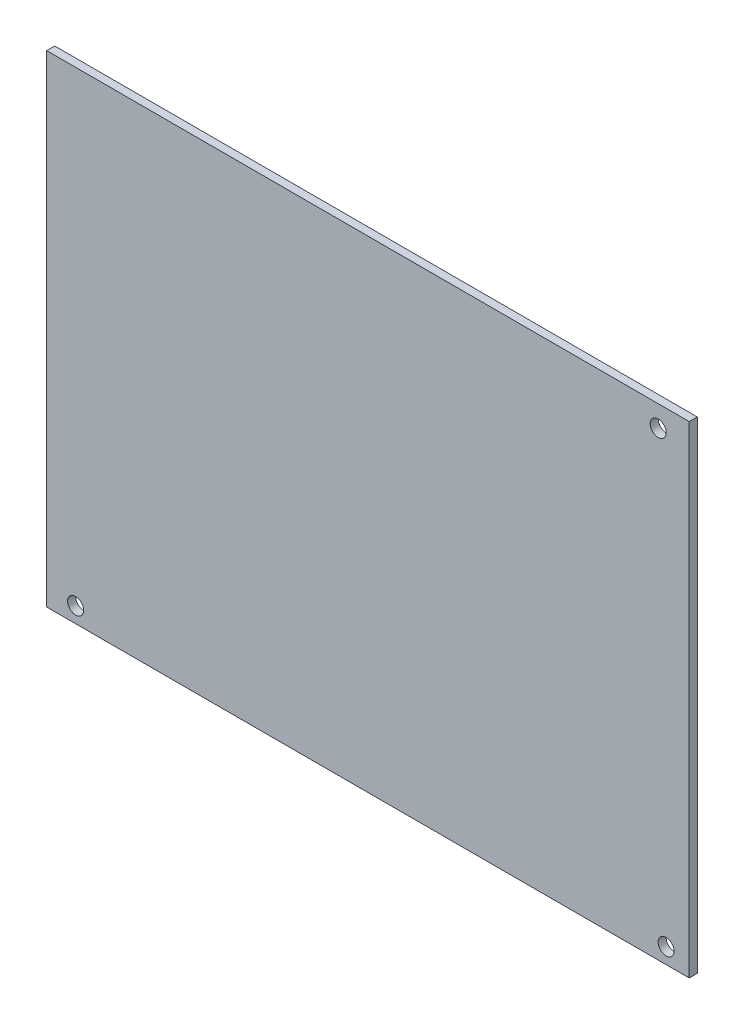
ISO-10303-21;
HEADER;
FILE_DESCRIPTION(('STEP AP214'),'2;1');
FILE_NAME('part.step','',(''),(''),'','','');
FILE_SCHEMA(('AUTOMOTIVE_DESIGN { 1 0 10303 214 1 1 1 1 }'));
ENDSEC;
DATA;
#1=APPLICATION_CONTEXT('core data for automotive mechanical design processes');
#2=APPLICATION_PROTOCOL_DEFINITION('international standard','automotive_design',2000,#1);
#3=PRODUCT_CONTEXT('',#1,'mechanical');
#4=PRODUCT('Part','Part','',(#3));
#5=PRODUCT_RELATED_PRODUCT_CATEGORY('part','',(#4));
#6=PRODUCT_DEFINITION_FORMATION('','',#4);
#7=PRODUCT_DEFINITION_CONTEXT('part definition',#1,'design');
#8=PRODUCT_DEFINITION('design','',#6,#7);
#9=PRODUCT_DEFINITION_SHAPE('','',#8);
#10=(LENGTH_UNIT() NAMED_UNIT(*) SI_UNIT(.MILLI.,.METRE.));
#11=(NAMED_UNIT(*) PLANE_ANGLE_UNIT() SI_UNIT($,.RADIAN.));
#12=(NAMED_UNIT(*) SI_UNIT($,.STERADIAN.) SOLID_ANGLE_UNIT());
#13=UNCERTAINTY_MEASURE_WITH_UNIT(LENGTH_MEASURE(1.E-05),#10,'distance_accuracy_value','');
#14=(GEOMETRIC_REPRESENTATION_CONTEXT(3) GLOBAL_UNCERTAINTY_ASSIGNED_CONTEXT((#13)) GLOBAL_UNIT_ASSIGNED_CONTEXT((#10,
#11,#12)) REPRESENTATION_CONTEXT('',''));
#15=CARTESIAN_POINT('',(0.,0.,0.));
#16=DIRECTION('',(0.,0.,1.));
#17=DIRECTION('',(1.,0.,0.));
#18=AXIS2_PLACEMENT_3D('',#15,#16,#17);
#19=CARTESIAN_POINT('',(0.,0.,2.));
#20=DIRECTION('',(1.,0.,0.));
#21=DIRECTION('',(0.,0.,-1.));
#22=AXIS2_PLACEMENT_3D('',#19,#20,#21);
#23=PLANE('',#22);
#24=DIRECTION('',(0.,-1.,0.));
#25=VECTOR('',#24,1.);
#26=CARTESIAN_POINT('',(0.,0.,0.));
#27=LINE('',#26,#25);
#28=CARTESIAN_POINT('',(0.,120.,0.));
#29=VERTEX_POINT('',#28);
#30=CARTESIAN_POINT('',(0.,0.,0.));
#31=VERTEX_POINT('',#30);
#32=EDGE_CURVE('E100',#29,#31,#27,.T.);
#33=ORIENTED_EDGE('',*,*,#32,.T.);
#34=DIRECTION('',(0.,0.,-1.));
#35=VECTOR('',#34,1.);
#36=CARTESIAN_POINT('',(0.,0.,2.));
#37=LINE('',#36,#35);
#38=CARTESIAN_POINT('',(0.,0.,2.));
#39=VERTEX_POINT('',#38);
#40=EDGE_CURVE('E11',#39,#31,#37,.T.);
#41=ORIENTED_EDGE('',*,*,#40,.F.);
#42=DIRECTION('',(0.,-1.,0.));
#43=VECTOR('',#42,1.);
#44=CARTESIAN_POINT('',(0.,0.,2.));
#45=LINE('',#44,#43);
#46=CARTESIAN_POINT('',(0.,120.,2.));
#47=VERTEX_POINT('',#46);
#48=EDGE_CURVE('E88',#47,#39,#45,.T.);
#49=ORIENTED_EDGE('',*,*,#48,.F.);
#50=DIRECTION('',(0.,0.,-1.));
#51=VECTOR('',#50,1.);
#52=CARTESIAN_POINT('',(0.,120.,2.));
#53=LINE('',#52,#51);
#54=EDGE_CURVE('E96',#47,#29,#53,.T.);
#55=ORIENTED_EDGE('',*,*,#54,.T.);
#56=EDGE_LOOP('',(#33,#41,#49,#55));
#57=FACE_BOUND('',#56,.T.);
#58=ADVANCED_FACE('F37',(#57),#23,.F.);
#59=CARTESIAN_POINT('',(0.,0.,2.));
#60=DIRECTION('',(0.,1.,0.));
#61=DIRECTION('',(0.,0.,1.));
#62=AXIS2_PLACEMENT_3D('',#59,#60,#61);
#63=PLANE('',#62);
#64=DIRECTION('',(1.,0.,0.));
#65=VECTOR('',#64,1.);
#66=CARTESIAN_POINT('',(0.,0.,0.));
#67=LINE('',#66,#65);
#68=CARTESIAN_POINT('',(160.,0.,0.));
#69=VERTEX_POINT('',#68);
#70=EDGE_CURVE('E92',#31,#69,#67,.T.);
#71=ORIENTED_EDGE('',*,*,#70,.T.);
#72=DIRECTION('',(0.,0.,-1.));
#73=VECTOR('',#72,1.);
#74=CARTESIAN_POINT('',(160.,0.,2.));
#75=LINE('',#74,#73);
#76=CARTESIAN_POINT('',(160.,0.,2.));
#77=VERTEX_POINT('',#76);
#78=EDGE_CURVE('E45',#77,#69,#75,.T.);
#79=ORIENTED_EDGE('',*,*,#78,.F.);
#80=DIRECTION('',(1.,0.,0.));
#81=VECTOR('',#80,1.);
#82=CARTESIAN_POINT('',(0.,0.,2.));
#83=LINE('',#82,#81);
#84=EDGE_CURVE('E83',#39,#77,#83,.T.);
#85=ORIENTED_EDGE('',*,*,#84,.F.);
#86=ORIENTED_EDGE('',*,*,#40,.T.);
#87=EDGE_LOOP('',(#71,#79,#85,#86));
#88=FACE_BOUND('',#87,.T.);
#89=ADVANCED_FACE('F91',(#88),#63,.F.);
#90=CARTESIAN_POINT('',(160.,0.,2.));
#91=DIRECTION('',(-1.,0.,0.));
#92=DIRECTION('',(0.,0.,1.));
#93=AXIS2_PLACEMENT_3D('',#90,#91,#92);
#94=PLANE('',#93);
#95=DIRECTION('',(0.,1.,0.));
#96=VECTOR('',#95,1.);
#97=CARTESIAN_POINT('',(160.,0.,0.));
#98=LINE('',#97,#96);
#99=CARTESIAN_POINT('',(160.,120.,0.));
#100=VERTEX_POINT('',#99);
#101=EDGE_CURVE('E70',#69,#100,#98,.T.);
#102=ORIENTED_EDGE('',*,*,#101,.T.);
#103=DIRECTION('',(0.,0.,-1.));
#104=VECTOR('',#103,1.);
#105=CARTESIAN_POINT('',(160.,120.,2.));
#106=LINE('',#105,#104);
#107=CARTESIAN_POINT('',(160.,120.,2.));
#108=VERTEX_POINT('',#107);
#109=EDGE_CURVE('E93',#108,#100,#106,.T.);
#110=ORIENTED_EDGE('',*,*,#109,.F.);
#111=DIRECTION('',(0.,1.,0.));
#112=VECTOR('',#111,1.);
#113=CARTESIAN_POINT('',(160.,0.,2.));
#114=LINE('',#113,#112);
#115=EDGE_CURVE('E86',#77,#108,#114,.T.);
#116=ORIENTED_EDGE('',*,*,#115,.F.);
#117=ORIENTED_EDGE('',*,*,#78,.T.);
#118=EDGE_LOOP('',(#102,#110,#116,#117));
#119=FACE_BOUND('',#118,.T.);
#120=ADVANCED_FACE('F94',(#119),#94,.F.);
#121=CARTESIAN_POINT('',(0.,120.,2.));
#122=DIRECTION('',(0.,-1.,0.));
#123=DIRECTION('',(0.,0.,-1.));
#124=AXIS2_PLACEMENT_3D('',#121,#122,#123);
#125=PLANE('',#124);
#126=DIRECTION('',(-1.,0.,0.));
#127=VECTOR('',#126,1.);
#128=CARTESIAN_POINT('',(0.,120.,0.));
#129=LINE('',#128,#127);
#130=EDGE_CURVE('E76',#100,#29,#129,.T.);
#131=ORIENTED_EDGE('',*,*,#130,.T.);
#132=ORIENTED_EDGE('',*,*,#54,.F.);
#133=DIRECTION('',(-1.,0.,0.));
#134=VECTOR('',#133,1.);
#135=CARTESIAN_POINT('',(0.,120.,2.));
#136=LINE('',#135,#134);
#137=EDGE_CURVE('E53',#108,#47,#136,.T.);
#138=ORIENTED_EDGE('',*,*,#137,.F.);
#139=ORIENTED_EDGE('',*,*,#109,.T.);
#140=EDGE_LOOP('',(#131,#132,#138,#139));
#141=FACE_BOUND('',#140,.T.);
#142=ADVANCED_FACE('F108',(#141),#125,.F.);
#143=CARTESIAN_POINT('',(0.,0.,2.));
#144=DIRECTION('',(0.,0.,-1.));
#145=DIRECTION('',(-1.,0.,0.));
#146=AXIS2_PLACEMENT_3D('',#143,#144,#145);
#147=PLANE('',#146);
#148=CARTESIAN_POINT('',(7.1942728253408,3.87144678406815,2.));
#149=DIRECTION('',(0.,0.,-1.));
#150=DIRECTION('',(-1.,0.,0.));
#151=AXIS2_PLACEMENT_3D('',#148,#149,#150);
#152=CIRCLE('',#151,2.);
#153=CARTESIAN_POINT('',(5.1942728253408,3.87144678406815,2.));
#154=VERTEX_POINT('',#153);
#155=EDGE_CURVE('E103',#154,#154,#152,.T.);
#156=ORIENTED_EDGE('',*,*,#155,.T.);
#157=EDGE_LOOP('',(#156));
#158=FACE_BOUND('',#157,.T.);
#159=CARTESIAN_POINT('',(154.240322784012,3.87144678406815,2.));
#160=DIRECTION('',(0.,0.,-1.));
#161=DIRECTION('',(-1.,0.,0.));
#162=AXIS2_PLACEMENT_3D('',#159,#160,#161);
#163=CIRCLE('',#162,2.);
#164=CARTESIAN_POINT('',(152.240322784012,3.87144678406815,2.));
#165=VERTEX_POINT('',#164);
#166=EDGE_CURVE('E120',#165,#165,#163,.T.);
#167=ORIENTED_EDGE('',*,*,#166,.T.);
#168=EDGE_LOOP('',(#167));
#169=FACE_BOUND('',#168,.T.);
#170=CARTESIAN_POINT('',(152.267753821152,114.693957606579,2.));
#171=DIRECTION('',(0.,0.,-1.));
#172=DIRECTION('',(-1.,0.,0.));
#173=AXIS2_PLACEMENT_3D('',#170,#171,#172);
#174=CIRCLE('',#173,2.);
#175=CARTESIAN_POINT('',(150.267753821152,114.693957606579,2.));
#176=VERTEX_POINT('',#175);
#177=EDGE_CURVE('E114',#176,#176,#174,.T.);
#178=ORIENTED_EDGE('',*,*,#177,.T.);
#179=EDGE_LOOP('',(#178));
#180=FACE_BOUND('',#179,.T.);
#181=ORIENTED_EDGE('',*,*,#48,.T.);
#182=ORIENTED_EDGE('',*,*,#84,.T.);
#183=ORIENTED_EDGE('',*,*,#115,.T.);
#184=ORIENTED_EDGE('',*,*,#137,.T.);
#185=EDGE_LOOP('',(#181,#182,#183,#184));
#186=FACE_BOUND('',#185,.T.);
#187=ADVANCED_FACE('F84',(#158,#169,#180,#186),#147,.F.);
#188=CARTESIAN_POINT('',(0.,0.,0.));
#189=DIRECTION('',(0.,0.,-1.));
#190=DIRECTION('',(-1.,0.,0.));
#191=AXIS2_PLACEMENT_3D('',#188,#189,#190);
#192=PLANE('',#191);
#193=CARTESIAN_POINT('',(7.1942728253408,3.87144678406815,0.));
#194=DIRECTION('',(0.,0.,-1.));
#195=DIRECTION('',(-1.,0.,0.));
#196=AXIS2_PLACEMENT_3D('',#193,#194,#195);
#197=CIRCLE('',#196,2.);
#198=CARTESIAN_POINT('',(5.1942728253408,3.87144678406815,0.));
#199=VERTEX_POINT('',#198);
#200=EDGE_CURVE('E126',#199,#199,#197,.T.);
#201=ORIENTED_EDGE('',*,*,#200,.F.);
#202=EDGE_LOOP('',(#201));
#203=FACE_BOUND('',#202,.T.);
#204=CARTESIAN_POINT('',(154.240322784012,3.87144678406815,0.));
#205=DIRECTION('',(0.,0.,-1.));
#206=DIRECTION('',(-1.,0.,0.));
#207=AXIS2_PLACEMENT_3D('',#204,#205,#206);
#208=CIRCLE('',#207,2.);
#209=CARTESIAN_POINT('',(152.240322784012,3.87144678406815,0.));
#210=VERTEX_POINT('',#209);
#211=EDGE_CURVE('E123',#210,#210,#208,.T.);
#212=ORIENTED_EDGE('',*,*,#211,.F.);
#213=EDGE_LOOP('',(#212));
#214=FACE_BOUND('',#213,.T.);
#215=CARTESIAN_POINT('',(152.267753821152,114.693957606579,0.));
#216=DIRECTION('',(0.,0.,-1.));
#217=DIRECTION('',(-1.,0.,0.));
#218=AXIS2_PLACEMENT_3D('',#215,#216,#217);
#219=CIRCLE('',#218,2.);
#220=CARTESIAN_POINT('',(150.267753821152,114.693957606579,0.));
#221=VERTEX_POINT('',#220);
#222=EDGE_CURVE('E117',#221,#221,#219,.T.);
#223=ORIENTED_EDGE('',*,*,#222,.F.);
#224=EDGE_LOOP('',(#223));
#225=FACE_BOUND('',#224,.T.);
#226=ORIENTED_EDGE('',*,*,#32,.F.);
#227=ORIENTED_EDGE('',*,*,#130,.F.);
#228=ORIENTED_EDGE('',*,*,#101,.F.);
#229=ORIENTED_EDGE('',*,*,#70,.F.);
#230=EDGE_LOOP('',(#226,#227,#228,#229));
#231=FACE_BOUND('',#230,.T.);
#232=ADVANCED_FACE('F111',(#203,#214,#225,#231),#192,.T.);
#233=CARTESIAN_POINT('',(152.267753821152,114.693957606579,2.));
#234=DIRECTION('',(0.,0.,-1.));
#235=DIRECTION('',(-1.,0.,0.));
#236=AXIS2_PLACEMENT_3D('',#233,#234,#235);
#237=CYLINDRICAL_SURFACE('',#236,2.);
#238=ORIENTED_EDGE('',*,*,#177,.F.);
#239=EDGE_LOOP('',(#238));
#240=FACE_BOUND('',#239,.T.);
#241=ORIENTED_EDGE('',*,*,#222,.T.);
#242=EDGE_LOOP('',(#241));
#243=FACE_BOUND('',#242,.T.);
#244=ADVANCED_FACE('F143',(#240,#243),#237,.F.);
#245=CARTESIAN_POINT('',(154.240322784012,3.87144678406815,2.));
#246=DIRECTION('',(0.,0.,-1.));
#247=DIRECTION('',(-1.,0.,0.));
#248=AXIS2_PLACEMENT_3D('',#245,#246,#247);
#249=CYLINDRICAL_SURFACE('',#248,2.);
#250=ORIENTED_EDGE('',*,*,#166,.F.);
#251=EDGE_LOOP('',(#250));
#252=FACE_BOUND('',#251,.T.);
#253=ORIENTED_EDGE('',*,*,#211,.T.);
#254=EDGE_LOOP('',(#253));
#255=FACE_BOUND('',#254,.T.);
#256=ADVANCED_FACE('F137',(#252,#255),#249,.F.);
#257=CARTESIAN_POINT('',(7.1942728253408,3.87144678406815,2.));
#258=DIRECTION('',(0.,0.,-1.));
#259=DIRECTION('',(-1.,0.,0.));
#260=AXIS2_PLACEMENT_3D('',#257,#258,#259);
#261=CYLINDRICAL_SURFACE('',#260,2.);
#262=ORIENTED_EDGE('',*,*,#155,.F.);
#263=EDGE_LOOP('',(#262));
#264=FACE_BOUND('',#263,.T.);
#265=ORIENTED_EDGE('',*,*,#200,.T.);
#266=EDGE_LOOP('',(#265));
#267=FACE_BOUND('',#266,.T.);
#268=ADVANCED_FACE('F134',(#264,#267),#261,.F.);
#269=CLOSED_SHELL('',(#58,#89,#120,#142,#187,#232,#244,#256,#268));
#270=MANIFOLD_SOLID_BREP('B2',#269);
#271=ADVANCED_BREP_SHAPE_REPRESENTATION('',(#18,#270),#14);
#272=SHAPE_DEFINITION_REPRESENTATION(#9,#271);
ENDSEC;
END-ISO-10303-21;
